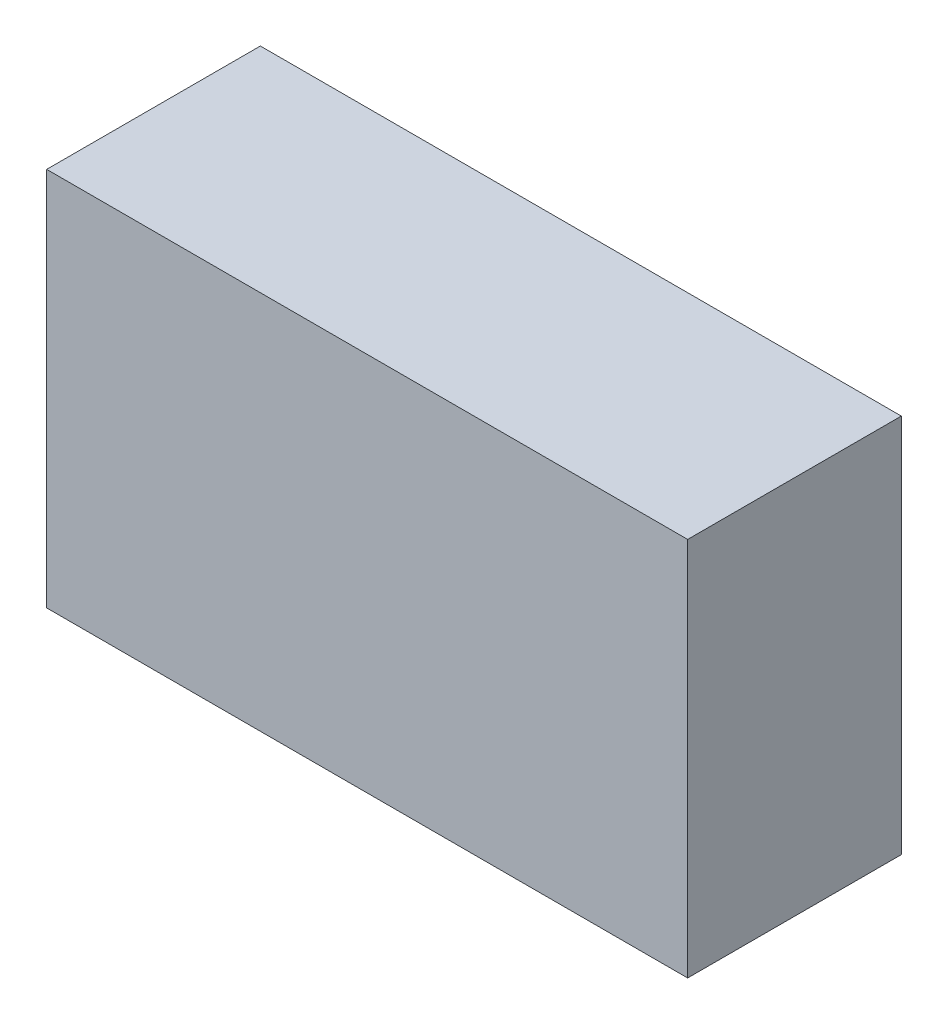
ISO-10303-21;
HEADER;
FILE_DESCRIPTION(('STEP AP214'),'2;1');
FILE_NAME('part.step','',(''),(''),'','','');
FILE_SCHEMA(('AUTOMOTIVE_DESIGN { 1 0 10303 214 1 1 1 1 }'));
ENDSEC;
DATA;
#1=APPLICATION_CONTEXT('core data for automotive mechanical design processes');
#2=APPLICATION_PROTOCOL_DEFINITION('international standard','automotive_design',2000,#1);
#3=PRODUCT_CONTEXT('',#1,'mechanical');
#4=PRODUCT('Part','Part','',(#3));
#5=PRODUCT_RELATED_PRODUCT_CATEGORY('part','',(#4));
#6=PRODUCT_DEFINITION_FORMATION('','',#4);
#7=PRODUCT_DEFINITION_CONTEXT('part definition',#1,'design');
#8=PRODUCT_DEFINITION('design','',#6,#7);
#9=PRODUCT_DEFINITION_SHAPE('','',#8);
#10=(LENGTH_UNIT() NAMED_UNIT(*) SI_UNIT(.MILLI.,.METRE.));
#11=(NAMED_UNIT(*) PLANE_ANGLE_UNIT() SI_UNIT($,.RADIAN.));
#12=(NAMED_UNIT(*) SI_UNIT($,.STERADIAN.) SOLID_ANGLE_UNIT());
#13=UNCERTAINTY_MEASURE_WITH_UNIT(LENGTH_MEASURE(1.E-05),#10,'distance_accuracy_value','');
#14=(GEOMETRIC_REPRESENTATION_CONTEXT(3) GLOBAL_UNCERTAINTY_ASSIGNED_CONTEXT((#13)) GLOBAL_UNIT_ASSIGNED_CONTEXT((#10,
#11,#12)) REPRESENTATION_CONTEXT('',''));
#15=CARTESIAN_POINT('',(0.,0.,0.));
#16=DIRECTION('',(0.,0.,1.));
#17=DIRECTION('',(1.,0.,0.));
#18=AXIS2_PLACEMENT_3D('',#15,#16,#17);
#19=CARTESIAN_POINT('',(53.3,40.,-35.));
#20=DIRECTION('',(0.,0.,-1.));
#21=DIRECTION('',(-1.,0.,0.));
#22=AXIS2_PLACEMENT_3D('',#19,#20,#21);
#23=CYLINDRICAL_SURFACE('',#22,1.5);
#24=CARTESIAN_POINT('',(53.3,40.,-45.));
#25=DIRECTION('',(0.,0.,-1.));
#26=DIRECTION('',(-1.,0.,0.));
#27=AXIS2_PLACEMENT_3D('',#24,#25,#26);
#28=CIRCLE('',#27,1.5);
#29=CARTESIAN_POINT('',(51.8,40.,-45.));
#30=VERTEX_POINT('',#29);
#31=EDGE_CURVE('E191',#30,#30,#28,.T.);
#32=ORIENTED_EDGE('',*,*,#31,.T.);
#33=EDGE_LOOP('',(#32));
#34=FACE_BOUND('',#33,.T.);
#35=CARTESIAN_POINT('',(53.3,40.,-40.35));
#36=DIRECTION('',(0.,0.,1.));
#37=DIRECTION('',(1.,0.,0.));
#38=AXIS2_PLACEMENT_3D('',#35,#36,#37);
#39=CIRCLE('',#38,1.5);
#40=CARTESIAN_POINT('',(54.8,40.,-40.35));
#41=VERTEX_POINT('',#40);
#42=EDGE_CURVE('E175',#41,#41,#39,.F.);
#43=ORIENTED_EDGE('',*,*,#42,.F.);
#44=EDGE_LOOP('',(#43));
#45=FACE_BOUND('',#44,.T.);
#46=ADVANCED_FACE('F37',(#34,#45),#23,.F.);
#47=CARTESIAN_POINT('',(53.3,58.35,-35.));
#48=DIRECTION('',(0.,0.,-1.));
#49=DIRECTION('',(-1.,0.,0.));
#50=AXIS2_PLACEMENT_3D('',#47,#48,#49);
#51=CYLINDRICAL_SURFACE('',#50,1.5);
#52=CARTESIAN_POINT('',(53.3,58.35,-45.));
#53=DIRECTION('',(0.,0.,-1.));
#54=DIRECTION('',(-1.,0.,0.));
#55=AXIS2_PLACEMENT_3D('',#52,#53,#54);
#56=CIRCLE('',#55,1.5);
#57=CARTESIAN_POINT('',(51.8,58.35,-45.));
#58=VERTEX_POINT('',#57);
#59=EDGE_CURVE('E188',#58,#58,#56,.T.);
#60=ORIENTED_EDGE('',*,*,#59,.T.);
#61=EDGE_LOOP('',(#60));
#62=FACE_BOUND('',#61,.T.);
#63=CARTESIAN_POINT('',(53.3,58.35,-40.35));
#64=DIRECTION('',(0.,0.,1.));
#65=DIRECTION('',(1.,0.,0.));
#66=AXIS2_PLACEMENT_3D('',#63,#64,#65);
#67=CIRCLE('',#66,1.5);
#68=CARTESIAN_POINT('',(54.8,58.35,-40.35));
#69=VERTEX_POINT('',#68);
#70=EDGE_CURVE('E172',#69,#69,#67,.F.);
#71=ORIENTED_EDGE('',*,*,#70,.F.);
#72=EDGE_LOOP('',(#71));
#73=FACE_BOUND('',#72,.T.);
#74=ADVANCED_FACE('F271',(#62,#73),#51,.F.);
#75=CARTESIAN_POINT('',(53.3,21.65,-35.));
#76=DIRECTION('',(0.,0.,-1.));
#77=DIRECTION('',(-1.,0.,0.));
#78=AXIS2_PLACEMENT_3D('',#75,#76,#77);
#79=CYLINDRICAL_SURFACE('',#78,1.5);
#80=CARTESIAN_POINT('',(53.3,21.65,-45.));
#81=DIRECTION('',(0.,0.,-1.));
#82=DIRECTION('',(-1.,0.,0.));
#83=AXIS2_PLACEMENT_3D('',#80,#81,#82);
#84=CIRCLE('',#83,1.5);
#85=CARTESIAN_POINT('',(51.8,21.65,-45.));
#86=VERTEX_POINT('',#85);
#87=EDGE_CURVE('E192',#86,#86,#84,.T.);
#88=ORIENTED_EDGE('',*,*,#87,.T.);
#89=EDGE_LOOP('',(#88));
#90=FACE_BOUND('',#89,.T.);
#91=CARTESIAN_POINT('',(53.3,21.65,-40.35));
#92=DIRECTION('',(0.,0.,1.));
#93=DIRECTION('',(1.,0.,0.));
#94=AXIS2_PLACEMENT_3D('',#91,#92,#93);
#95=CIRCLE('',#94,1.5);
#96=CARTESIAN_POINT('',(54.8,21.65,-40.35));
#97=VERTEX_POINT('',#96);
#98=EDGE_CURVE('E169',#97,#97,#95,.F.);
#99=ORIENTED_EDGE('',*,*,#98,.F.);
#100=EDGE_LOOP('',(#99));
#101=FACE_BOUND('',#100,.T.);
#102=ADVANCED_FACE('F277',(#90,#101),#79,.F.);
#103=CARTESIAN_POINT('',(23.3,58.35,-35.));
#104=DIRECTION('',(0.,0.,-1.));
#105=DIRECTION('',(-1.,0.,0.));
#106=AXIS2_PLACEMENT_3D('',#103,#104,#105);
#107=CYLINDRICAL_SURFACE('',#106,1.5);
#108=CARTESIAN_POINT('',(23.3,58.35,-45.));
#109=DIRECTION('',(0.,0.,-1.));
#110=DIRECTION('',(-1.,0.,0.));
#111=AXIS2_PLACEMENT_3D('',#108,#109,#110);
#112=CIRCLE('',#111,1.5);
#113=CARTESIAN_POINT('',(21.8,58.35,-45.));
#114=VERTEX_POINT('',#113);
#115=EDGE_CURVE('E195',#114,#114,#112,.T.);
#116=ORIENTED_EDGE('',*,*,#115,.T.);
#117=EDGE_LOOP('',(#116));
#118=FACE_BOUND('',#117,.T.);
#119=CARTESIAN_POINT('',(23.3,58.35,-40.35));
#120=DIRECTION('',(0.,0.,1.));
#121=DIRECTION('',(1.,0.,0.));
#122=AXIS2_PLACEMENT_3D('',#119,#120,#121);
#123=CIRCLE('',#122,1.5);
#124=CARTESIAN_POINT('',(24.8,58.35,-40.35));
#125=VERTEX_POINT('',#124);
#126=EDGE_CURVE('E166',#125,#125,#123,.F.);
#127=ORIENTED_EDGE('',*,*,#126,.F.);
#128=EDGE_LOOP('',(#127));
#129=FACE_BOUND('',#128,.T.);
#130=ADVANCED_FACE('F337',(#118,#129),#107,.F.);
#131=CARTESIAN_POINT('',(23.3,21.65,-35.));
#132=DIRECTION('',(0.,0.,-1.));
#133=DIRECTION('',(-1.,0.,0.));
#134=AXIS2_PLACEMENT_3D('',#131,#132,#133);
#135=CYLINDRICAL_SURFACE('',#134,1.5);
#136=CARTESIAN_POINT('',(23.3,21.65,-45.));
#137=DIRECTION('',(0.,0.,-1.));
#138=DIRECTION('',(-1.,0.,0.));
#139=AXIS2_PLACEMENT_3D('',#136,#137,#138);
#140=CIRCLE('',#139,1.5);
#141=CARTESIAN_POINT('',(21.8,21.65,-45.));
#142=VERTEX_POINT('',#141);
#143=EDGE_CURVE('E198',#142,#142,#140,.T.);
#144=ORIENTED_EDGE('',*,*,#143,.T.);
#145=EDGE_LOOP('',(#144));
#146=FACE_BOUND('',#145,.T.);
#147=CARTESIAN_POINT('',(23.3,21.65,-40.35));
#148=DIRECTION('',(0.,0.,1.));
#149=DIRECTION('',(1.,0.,0.));
#150=AXIS2_PLACEMENT_3D('',#147,#148,#149);
#151=CIRCLE('',#150,1.5);
#152=CARTESIAN_POINT('',(24.8,21.65,-40.35));
#153=VERTEX_POINT('',#152);
#154=EDGE_CURVE('E163',#153,#153,#151,.F.);
#155=ORIENTED_EDGE('',*,*,#154,.F.);
#156=EDGE_LOOP('',(#155));
#157=FACE_BOUND('',#156,.T.);
#158=ADVANCED_FACE('F347',(#146,#157),#135,.F.);
#159=CARTESIAN_POINT('',(115.7,40.,-35.));
#160=DIRECTION('',(0.,0.,-1.));
#161=DIRECTION('',(-1.,0.,0.));
#162=AXIS2_PLACEMENT_3D('',#159,#160,#161);
#163=CYLINDRICAL_SURFACE('',#162,1.5);
#164=CARTESIAN_POINT('',(115.7,40.,-45.));
#165=DIRECTION('',(0.,0.,-1.));
#166=DIRECTION('',(-1.,0.,0.));
#167=AXIS2_PLACEMENT_3D('',#164,#165,#166);
#168=CIRCLE('',#167,1.5);
#169=CARTESIAN_POINT('',(114.2,40.,-45.));
#170=VERTEX_POINT('',#169);
#171=EDGE_CURVE('E201',#170,#170,#168,.T.);
#172=ORIENTED_EDGE('',*,*,#171,.T.);
#173=EDGE_LOOP('',(#172));
#174=FACE_BOUND('',#173,.T.);
#175=CARTESIAN_POINT('',(115.7,40.,-40.35));
#176=DIRECTION('',(0.,0.,1.));
#177=DIRECTION('',(1.,0.,0.));
#178=AXIS2_PLACEMENT_3D('',#175,#176,#177);
#179=CIRCLE('',#178,1.5);
#180=CARTESIAN_POINT('',(117.2,40.,-40.35));
#181=VERTEX_POINT('',#180);
#182=EDGE_CURVE('E160',#181,#181,#179,.F.);
#183=ORIENTED_EDGE('',*,*,#182,.F.);
#184=EDGE_LOOP('',(#183));
#185=FACE_BOUND('',#184,.T.);
#186=ADVANCED_FACE('F357',(#174,#185),#163,.F.);
#187=CARTESIAN_POINT('',(115.7,62.,-35.));
#188=DIRECTION('',(0.,0.,-1.));
#189=DIRECTION('',(-1.,0.,0.));
#190=AXIS2_PLACEMENT_3D('',#187,#188,#189);
#191=CYLINDRICAL_SURFACE('',#190,1.5);
#192=CARTESIAN_POINT('',(115.7,62.,-45.));
#193=DIRECTION('',(0.,0.,-1.));
#194=DIRECTION('',(-1.,0.,0.));
#195=AXIS2_PLACEMENT_3D('',#192,#193,#194);
#196=CIRCLE('',#195,1.5);
#197=CARTESIAN_POINT('',(114.2,62.,-45.));
#198=VERTEX_POINT('',#197);
#199=EDGE_CURVE('E182',#198,#198,#196,.T.);
#200=ORIENTED_EDGE('',*,*,#199,.T.);
#201=EDGE_LOOP('',(#200));
#202=FACE_BOUND('',#201,.T.);
#203=CARTESIAN_POINT('',(115.7,62.,-40.35));
#204=DIRECTION('',(0.,0.,1.));
#205=DIRECTION('',(1.,0.,0.));
#206=AXIS2_PLACEMENT_3D('',#203,#204,#205);
#207=CIRCLE('',#206,1.5);
#208=CARTESIAN_POINT('',(117.2,62.,-40.35));
#209=VERTEX_POINT('',#208);
#210=EDGE_CURVE('E41',#209,#209,#207,.F.);
#211=ORIENTED_EDGE('',*,*,#210,.F.);
#212=EDGE_LOOP('',(#211));
#213=FACE_BOUND('',#212,.T.);
#214=ADVANCED_FACE('F253',(#202,#213),#191,.F.);
#215=CARTESIAN_POINT('',(0.,0.,-45.));
#216=DIRECTION('',(-1.,0.,0.));
#217=DIRECTION('',(0.,0.,1.));
#218=AXIS2_PLACEMENT_3D('',#215,#216,#217);
#219=PLANE('',#218);
#220=CARTESIAN_POINT('',(0.,54.05,-15.));
#221=DIRECTION('',(-1.,0.,0.));
#222=DIRECTION('',(0.,0.,1.));
#223=AXIS2_PLACEMENT_3D('',#220,#221,#222);
#224=CIRCLE('',#223,1.5);
#225=CARTESIAN_POINT('',(0.,54.05,-13.5));
#226=VERTEX_POINT('',#225);
#227=EDGE_CURVE('E179',#226,#226,#224,.T.);
#228=ORIENTED_EDGE('',*,*,#227,.F.);
#229=EDGE_LOOP('',(#228));
#230=FACE_BOUND('',#229,.T.);
#231=CARTESIAN_POINT('',(0.,25.95,-15.));
#232=DIRECTION('',(-1.,0.,0.));
#233=DIRECTION('',(0.,0.,1.));
#234=AXIS2_PLACEMENT_3D('',#231,#232,#233);
#235=CIRCLE('',#234,1.5);
#236=CARTESIAN_POINT('',(0.,25.95,-13.5));
#237=VERTEX_POINT('',#236);
#238=EDGE_CURVE('E183',#237,#237,#235,.T.);
#239=ORIENTED_EDGE('',*,*,#238,.F.);
#240=EDGE_LOOP('',(#239));
#241=FACE_BOUND('',#240,.T.);
#242=CARTESIAN_POINT('',(0.,40.,-31.));
#243=DIRECTION('',(-1.,0.,0.));
#244=DIRECTION('',(0.,0.,1.));
#245=AXIS2_PLACEMENT_3D('',#242,#243,#244);
#246=CIRCLE('',#245,1.5);
#247=CARTESIAN_POINT('',(0.,40.,-29.5));
#248=VERTEX_POINT('',#247);
#249=EDGE_CURVE('E178',#248,#248,#246,.T.);
#250=ORIENTED_EDGE('',*,*,#249,.F.);
#251=EDGE_LOOP('',(#250));
#252=FACE_BOUND('',#251,.T.);
#253=DIRECTION('',(0.,-1.,0.));
#254=VECTOR('',#253,1.);
#255=CARTESIAN_POINT('',(0.,0.,0.));
#256=LINE('',#255,#254);
#257=CARTESIAN_POINT('',(0.,80.,0.));
#258=VERTEX_POINT('',#257);
#259=CARTESIAN_POINT('',(0.,0.,0.));
#260=VERTEX_POINT('',#259);
#261=EDGE_CURVE('E208',#258,#260,#256,.T.);
#262=ORIENTED_EDGE('',*,*,#261,.F.);
#263=DIRECTION('',(0.,0.,1.));
#264=VECTOR('',#263,1.);
#265=CARTESIAN_POINT('',(0.,80.,-45.));
#266=LINE('',#265,#264);
#267=CARTESIAN_POINT('',(0.,80.,-45.));
#268=VERTEX_POINT('',#267);
#269=EDGE_CURVE('E11',#268,#258,#266,.T.);
#270=ORIENTED_EDGE('',*,*,#269,.F.);
#271=DIRECTION('',(0.,-1.,0.));
#272=VECTOR('',#271,1.);
#273=CARTESIAN_POINT('',(0.,0.,-45.));
#274=LINE('',#273,#272);
#275=CARTESIAN_POINT('',(0.,0.,-45.));
#276=VERTEX_POINT('',#275);
#277=EDGE_CURVE('E209',#268,#276,#274,.T.);
#278=ORIENTED_EDGE('',*,*,#277,.T.);
#279=DIRECTION('',(0.,0.,1.));
#280=VECTOR('',#279,1.);
#281=CARTESIAN_POINT('',(0.,0.,-45.));
#282=LINE('',#281,#280);
#283=EDGE_CURVE('E82',#276,#260,#282,.T.);
#284=ORIENTED_EDGE('',*,*,#283,.T.);
#285=EDGE_LOOP('',(#262,#270,#278,#284));
#286=FACE_BOUND('',#285,.T.);
#287=ADVANCED_FACE('F39',(#230,#241,#252,#286),#219,.T.);
#288=CARTESIAN_POINT('',(0.,80.,-45.));
#289=DIRECTION('',(0.,1.,0.));
#290=DIRECTION('',(0.,0.,1.));
#291=AXIS2_PLACEMENT_3D('',#288,#289,#290);
#292=PLANE('',#291);
#293=DIRECTION('',(-1.,0.,0.));
#294=VECTOR('',#293,1.);
#295=CARTESIAN_POINT('',(0.,80.,0.));
#296=LINE('',#295,#294);
#297=CARTESIAN_POINT('',(135.,80.,0.));
#298=VERTEX_POINT('',#297);
#299=EDGE_CURVE('E212',#298,#258,#296,.T.);
#300=ORIENTED_EDGE('',*,*,#299,.F.);
#301=DIRECTION('',(0.,0.,1.));
#302=VECTOR('',#301,1.);
#303=CARTESIAN_POINT('',(135.,80.,-45.));
#304=LINE('',#303,#302);
#305=CARTESIAN_POINT('',(135.,80.,-45.));
#306=VERTEX_POINT('',#305);
#307=EDGE_CURVE('E47',#306,#298,#304,.T.);
#308=ORIENTED_EDGE('',*,*,#307,.F.);
#309=DIRECTION('',(-1.,0.,0.));
#310=VECTOR('',#309,1.);
#311=CARTESIAN_POINT('',(0.,80.,-45.));
#312=LINE('',#311,#310);
#313=EDGE_CURVE('E216',#306,#268,#312,.T.);
#314=ORIENTED_EDGE('',*,*,#313,.T.);
#315=ORIENTED_EDGE('',*,*,#269,.T.);
#316=EDGE_LOOP('',(#300,#308,#314,#315));
#317=FACE_BOUND('',#316,.T.);
#318=ADVANCED_FACE('F252',(#317),#292,.T.);
#319=CARTESIAN_POINT('',(135.,0.,-45.));
#320=DIRECTION('',(1.,0.,0.));
#321=DIRECTION('',(0.,0.,-1.));
#322=AXIS2_PLACEMENT_3D('',#319,#320,#321);
#323=PLANE('',#322);
#324=DIRECTION('',(0.,1.,0.));
#325=VECTOR('',#324,1.);
#326=CARTESIAN_POINT('',(135.,0.,0.));
#327=LINE('',#326,#325);
#328=CARTESIAN_POINT('',(135.,0.,0.));
#329=VERTEX_POINT('',#328);
#330=EDGE_CURVE('E223',#329,#298,#327,.T.);
#331=ORIENTED_EDGE('',*,*,#330,.F.);
#332=DIRECTION('',(0.,0.,1.));
#333=VECTOR('',#332,1.);
#334=CARTESIAN_POINT('',(135.,0.,-45.));
#335=LINE('',#334,#333);
#336=CARTESIAN_POINT('',(135.,0.,-45.));
#337=VERTEX_POINT('',#336);
#338=EDGE_CURVE('E228',#337,#329,#335,.T.);
#339=ORIENTED_EDGE('',*,*,#338,.F.);
#340=DIRECTION('',(0.,1.,0.));
#341=VECTOR('',#340,1.);
#342=CARTESIAN_POINT('',(135.,0.,-45.));
#343=LINE('',#342,#341);
#344=EDGE_CURVE('E214',#337,#306,#343,.T.);
#345=ORIENTED_EDGE('',*,*,#344,.T.);
#346=ORIENTED_EDGE('',*,*,#307,.T.);
#347=EDGE_LOOP('',(#331,#339,#345,#346));
#348=FACE_BOUND('',#347,.T.);
#349=ADVANCED_FACE('F258',(#348),#323,.T.);
#350=CARTESIAN_POINT('',(0.,0.,-45.));
#351=DIRECTION('',(0.,-1.,0.));
#352=DIRECTION('',(0.,0.,-1.));
#353=AXIS2_PLACEMENT_3D('',#350,#351,#352);
#354=PLANE('',#353);
#355=DIRECTION('',(1.,0.,0.));
#356=VECTOR('',#355,1.);
#357=CARTESIAN_POINT('',(0.,0.,0.));
#358=LINE('',#357,#356);
#359=EDGE_CURVE('E220',#260,#329,#358,.T.);
#360=ORIENTED_EDGE('',*,*,#359,.F.);
#361=ORIENTED_EDGE('',*,*,#283,.F.);
#362=DIRECTION('',(1.,0.,0.));
#363=VECTOR('',#362,1.);
#364=CARTESIAN_POINT('',(0.,0.,-45.));
#365=LINE('',#364,#363);
#366=EDGE_CURVE('E211',#276,#337,#365,.T.);
#367=ORIENTED_EDGE('',*,*,#366,.T.);
#368=ORIENTED_EDGE('',*,*,#338,.T.);
#369=EDGE_LOOP('',(#360,#361,#367,#368));
#370=FACE_BOUND('',#369,.T.);
#371=ADVANCED_FACE('F261',(#370),#354,.T.);
#372=CARTESIAN_POINT('',(0.,0.,-45.));
#373=DIRECTION('',(0.,0.,-1.));
#374=DIRECTION('',(-1.,0.,0.));
#375=AXIS2_PLACEMENT_3D('',#372,#373,#374);
#376=PLANE('',#375);
#377=ORIENTED_EDGE('',*,*,#199,.F.);
#378=EDGE_LOOP('',(#377));
#379=FACE_BOUND('',#378,.T.);
#380=ORIENTED_EDGE('',*,*,#171,.F.);
#381=EDGE_LOOP('',(#380));
#382=FACE_BOUND('',#381,.T.);
#383=ORIENTED_EDGE('',*,*,#143,.F.);
#384=EDGE_LOOP('',(#383));
#385=FACE_BOUND('',#384,.T.);
#386=ORIENTED_EDGE('',*,*,#115,.F.);
#387=EDGE_LOOP('',(#386));
#388=FACE_BOUND('',#387,.T.);
#389=ORIENTED_EDGE('',*,*,#87,.F.);
#390=EDGE_LOOP('',(#389));
#391=FACE_BOUND('',#390,.T.);
#392=ORIENTED_EDGE('',*,*,#59,.F.);
#393=EDGE_LOOP('',(#392));
#394=FACE_BOUND('',#393,.T.);
#395=ORIENTED_EDGE('',*,*,#31,.F.);
#396=EDGE_LOOP('',(#395));
#397=FACE_BOUND('',#396,.T.);
#398=ORIENTED_EDGE('',*,*,#277,.F.);
#399=ORIENTED_EDGE('',*,*,#313,.F.);
#400=ORIENTED_EDGE('',*,*,#344,.F.);
#401=ORIENTED_EDGE('',*,*,#366,.F.);
#402=EDGE_LOOP('',(#398,#399,#400,#401));
#403=FACE_BOUND('',#402,.T.);
#404=ADVANCED_FACE('F260',(#379,#382,#385,#388,#391,#394,#397,#403),#376,.T.);
#405=CARTESIAN_POINT('',(0.,0.,0.));
#406=DIRECTION('',(0.,0.,-1.));
#407=DIRECTION('',(-1.,0.,0.));
#408=AXIS2_PLACEMENT_3D('',#405,#406,#407);
#409=PLANE('',#408);
#410=ORIENTED_EDGE('',*,*,#261,.T.);
#411=ORIENTED_EDGE('',*,*,#359,.T.);
#412=ORIENTED_EDGE('',*,*,#330,.T.);
#413=ORIENTED_EDGE('',*,*,#299,.T.);
#414=EDGE_LOOP('',(#410,#411,#412,#413));
#415=FACE_BOUND('',#414,.T.);
#416=ADVANCED_FACE('F247',(#415),#409,.F.);
#417=CARTESIAN_POINT('',(10.,40.,-31.));
#418=DIRECTION('',(-1.,0.,0.));
#419=DIRECTION('',(0.,0.,1.));
#420=AXIS2_PLACEMENT_3D('',#417,#418,#419);
#421=CYLINDRICAL_SURFACE('',#420,1.5);
#422=CARTESIAN_POINT('',(6.97483396079881,40.,-31.));
#423=DIRECTION('',(-0.999657324975557,0.,-0.0261769483078695));
#424=DIRECTION('',(-0.0261769483078695,0.,0.999657324975557));
#425=AXIS2_PLACEMENT_3D('',#422,#423,#424);
#426=ELLIPSE('',#425,1.5005141887363,1.5);
#427=CARTESIAN_POINT('',(6.93555507844503,40.,-29.5));
#428=VERTEX_POINT('',#427);
#429=EDGE_CURVE('E157',#428,#428,#426,.F.);
#430=ORIENTED_EDGE('',*,*,#429,.T.);
#431=EDGE_LOOP('',(#430));
#432=FACE_BOUND('',#431,.T.);
#433=ORIENTED_EDGE('',*,*,#249,.T.);
#434=EDGE_LOOP('',(#433));
#435=FACE_BOUND('',#434,.T.);
#436=ADVANCED_FACE('F243',(#432,#435),#421,.F.);
#437=CARTESIAN_POINT('',(10.,25.95,-15.));
#438=DIRECTION('',(-1.,0.,0.));
#439=DIRECTION('',(0.,0.,1.));
#440=AXIS2_PLACEMENT_3D('',#437,#438,#439);
#441=CYLINDRICAL_SURFACE('',#440,1.5);
#442=CARTESIAN_POINT('',(6.55585921569188,25.95,-15.));
#443=DIRECTION('',(-0.999657324975557,0.,-0.0261769483078695));
#444=DIRECTION('',(-0.0261769483078695,0.,0.999657324975557));
#445=AXIS2_PLACEMENT_3D('',#442,#443,#444);
#446=ELLIPSE('',#445,1.5005141887363,1.5);
#447=CARTESIAN_POINT('',(6.5165803333381,25.95,-13.5));
#448=VERTEX_POINT('',#447);
#449=EDGE_CURVE('E154',#448,#448,#446,.F.);
#450=ORIENTED_EDGE('',*,*,#449,.T.);
#451=EDGE_LOOP('',(#450));
#452=FACE_BOUND('',#451,.T.);
#453=ORIENTED_EDGE('',*,*,#238,.T.);
#454=EDGE_LOOP('',(#453));
#455=FACE_BOUND('',#454,.T.);
#456=ADVANCED_FACE('F246',(#452,#455),#441,.F.);
#457=CARTESIAN_POINT('',(10.,54.05,-15.));
#458=DIRECTION('',(-1.,0.,0.));
#459=DIRECTION('',(0.,0.,1.));
#460=AXIS2_PLACEMENT_3D('',#457,#458,#459);
#461=CYLINDRICAL_SURFACE('',#460,1.5);
#462=CARTESIAN_POINT('',(6.55585921569187,54.05,-15.));
#463=DIRECTION('',(-0.999657324975557,0.,-0.0261769483078695));
#464=DIRECTION('',(-0.0261769483078695,0.,0.999657324975557));
#465=AXIS2_PLACEMENT_3D('',#462,#463,#464);
#466=ELLIPSE('',#465,1.5005141887363,1.5);
#467=CARTESIAN_POINT('',(6.5165803333381,54.05,-13.5));
#468=VERTEX_POINT('',#467);
#469=EDGE_CURVE('E121',#468,#468,#466,.F.);
#470=ORIENTED_EDGE('',*,*,#469,.T.);
#471=EDGE_LOOP('',(#470));
#472=FACE_BOUND('',#471,.T.);
#473=ORIENTED_EDGE('',*,*,#227,.T.);
#474=EDGE_LOOP('',(#473));
#475=FACE_BOUND('',#474,.T.);
#476=ADVANCED_FACE('F233',(#472,#475),#461,.F.);
#477=CARTESIAN_POINT('',(67.5,40.,-40.35));
#478=DIRECTION('',(0.,0.,1.));
#479=DIRECTION('',(1.,0.,0.));
#480=AXIS2_PLACEMENT_3D('',#477,#478,#479);
#481=PLANE('',#480);
#482=DIRECTION('',(0.,1.,0.));
#483=VECTOR('',#482,1.);
#484=CARTESIAN_POINT('',(127.780327672529,40.,-40.35));
#485=LINE('',#484,#483);
#486=CARTESIAN_POINT('',(127.780327672529,7.18150486374522,-40.35));
#487=VERTEX_POINT('',#486);
#488=CARTESIAN_POINT('',(127.780327672529,72.8184951362548,-40.35));
#489=VERTEX_POINT('',#488);
#490=EDGE_CURVE('E125',#487,#489,#485,.T.);
#491=ORIENTED_EDGE('',*,*,#490,.T.);
#492=DIRECTION('',(-1.,0.,0.));
#493=VECTOR('',#492,1.);
#494=CARTESIAN_POINT('',(67.5,72.8184951362548,-40.35));
#495=LINE('',#494,#493);
#496=CARTESIAN_POINT('',(7.21967232747066,72.8184951362548,-40.35));
#497=VERTEX_POINT('',#496);
#498=EDGE_CURVE('E131',#489,#497,#495,.T.);
#499=ORIENTED_EDGE('',*,*,#498,.T.);
#500=DIRECTION('',(0.,-1.,0.));
#501=VECTOR('',#500,1.);
#502=CARTESIAN_POINT('',(7.21967232747067,40.,-40.35));
#503=LINE('',#502,#501);
#504=CARTESIAN_POINT('',(7.21967232747068,7.18150486374522,-40.35));
#505=VERTEX_POINT('',#504);
#506=EDGE_CURVE('E137',#497,#505,#503,.T.);
#507=ORIENTED_EDGE('',*,*,#506,.T.);
#508=DIRECTION('',(1.,0.,0.));
#509=VECTOR('',#508,1.);
#510=CARTESIAN_POINT('',(67.5,7.18150486374522,-40.35));
#511=LINE('',#510,#509);
#512=EDGE_CURVE('E115',#505,#487,#511,.T.);
#513=ORIENTED_EDGE('',*,*,#512,.T.);
#514=EDGE_LOOP('',(#491,#499,#507,#513));
#515=FACE_BOUND('',#514,.T.);
#516=ORIENTED_EDGE('',*,*,#210,.T.);
#517=EDGE_LOOP('',(#516));
#518=FACE_BOUND('',#517,.T.);
#519=ORIENTED_EDGE('',*,*,#182,.T.);
#520=EDGE_LOOP('',(#519));
#521=FACE_BOUND('',#520,.T.);
#522=ORIENTED_EDGE('',*,*,#154,.T.);
#523=EDGE_LOOP('',(#522));
#524=FACE_BOUND('',#523,.T.);
#525=ORIENTED_EDGE('',*,*,#126,.T.);
#526=EDGE_LOOP('',(#525));
#527=FACE_BOUND('',#526,.T.);
#528=ORIENTED_EDGE('',*,*,#98,.T.);
#529=EDGE_LOOP('',(#528));
#530=FACE_BOUND('',#529,.T.);
#531=ORIENTED_EDGE('',*,*,#70,.T.);
#532=EDGE_LOOP('',(#531));
#533=FACE_BOUND('',#532,.T.);
#534=ORIENTED_EDGE('',*,*,#42,.T.);
#535=EDGE_LOOP('',(#534));
#536=FACE_BOUND('',#535,.T.);
#537=ADVANCED_FACE('F134',(#515,#518,#521,#524,#527,#530,#533,#536),#481,.T.);
#538=CARTESIAN_POINT('',(6.29400000000004,73.74875,-5.));
#539=DIRECTION('',(-0.999657324975557,0.,-0.0261769483078695));
#540=DIRECTION('',(-0.0261769483078695,0.,0.999657324975558));
#541=AXIS2_PLACEMENT_3D('',#538,#539,#540);
#542=PLANE('',#541);
#543=ORIENTED_EDGE('',*,*,#449,.F.);
#544=EDGE_LOOP('',(#543));
#545=FACE_BOUND('',#544,.T.);
#546=DIRECTION('',(0.,-1.,0.));
#547=VECTOR('',#546,1.);
#548=CARTESIAN_POINT('',(6.29400000000004,73.74875,-5.));
#549=LINE('',#548,#547);
#550=CARTESIAN_POINT('',(6.29400000000004,73.74875,-5.));
#551=VERTEX_POINT('',#550);
#552=CARTESIAN_POINT('',(6.29400000000005,6.25124999999999,-5.));
#553=VERTEX_POINT('',#552);
#554=EDGE_CURVE('E145',#551,#553,#549,.T.);
#555=ORIENTED_EDGE('',*,*,#554,.T.);
#556=DIRECTION('',(-0.0261678953385402,-0.0262974393748696,0.999311606024806));
#557=VECTOR('',#556,1.);
#558=CARTESIAN_POINT('',(6.3399921337941,6.2974698176247,-6.75636872937754));
#559=LINE('',#558,#557);
#560=EDGE_CURVE('E122',#505,#553,#559,.T.);
#561=ORIENTED_EDGE('',*,*,#560,.F.);
#562=ORIENTED_EDGE('',*,*,#506,.F.);
#563=DIRECTION('',(-0.0261678953385402,0.0262974393748696,0.999311606024806));
#564=VECTOR('',#563,1.);
#565=CARTESIAN_POINT('',(6.37782325738107,73.6645117759982,-8.20108105263997));
#566=LINE('',#565,#564);
#567=EDGE_CURVE('E139',#497,#551,#566,.T.);
#568=ORIENTED_EDGE('',*,*,#567,.T.);
#569=EDGE_LOOP('',(#555,#561,#562,#568));
#570=FACE_BOUND('',#569,.T.);
#571=ORIENTED_EDGE('',*,*,#469,.F.);
#572=EDGE_LOOP('',(#571));
#573=FACE_BOUND('',#572,.T.);
#574=ORIENTED_EDGE('',*,*,#429,.F.);
#575=EDGE_LOOP('',(#574));
#576=FACE_BOUND('',#575,.T.);
#577=ADVANCED_FACE('F236',(#545,#570,#573,#576),#542,.F.);
#578=CARTESIAN_POINT('',(128.706,6.25124999999999,-5.));
#579=DIRECTION('',(0.999657324975557,0.,-0.0261769483078695));
#580=DIRECTION('',(-0.0261769483078695,0.,-0.999657324975558));
#581=AXIS2_PLACEMENT_3D('',#578,#579,#580);
#582=PLANE('',#581);
#583=DIRECTION('',(0.,1.,0.));
#584=VECTOR('',#583,1.);
#585=CARTESIAN_POINT('',(128.706,6.25124999999999,-5.));
#586=LINE('',#585,#584);
#587=CARTESIAN_POINT('',(128.706,6.25124999999999,-5.));
#588=VERTEX_POINT('',#587);
#589=CARTESIAN_POINT('',(128.706,73.74875,-5.));
#590=VERTEX_POINT('',#589);
#591=EDGE_CURVE('E152',#588,#590,#586,.T.);
#592=ORIENTED_EDGE('',*,*,#591,.T.);
#593=DIRECTION('',(0.0261678953385402,0.0262974393748696,0.999311606024806));
#594=VECTOR('',#593,1.);
#595=CARTESIAN_POINT('',(128.660007866206,73.7025301823753,-6.75636872937754));
#596=LINE('',#595,#594);
#597=EDGE_CURVE('E127',#489,#590,#596,.T.);
#598=ORIENTED_EDGE('',*,*,#597,.F.);
#599=ORIENTED_EDGE('',*,*,#490,.F.);
#600=DIRECTION('',(0.0261678953385402,-0.0262974393748696,0.999311606024806));
#601=VECTOR('',#600,1.);
#602=CARTESIAN_POINT('',(128.622176742619,6.33548822400172,-8.20108105263997));
#603=LINE('',#602,#601);
#604=EDGE_CURVE('E111',#487,#588,#603,.T.);
#605=ORIENTED_EDGE('',*,*,#604,.T.);
#606=EDGE_LOOP('',(#592,#598,#599,#605));
#607=FACE_BOUND('',#606,.T.);
#608=ADVANCED_FACE('F126',(#607),#582,.F.);
#609=CARTESIAN_POINT('',(6.29400000000005,6.25124999999999,-5.));
#610=DIRECTION('',(0.,-0.99965392552087,-0.0263064477023425));
#611=DIRECTION('',(0.,0.0263064477023425,-0.999653925520869));
#612=AXIS2_PLACEMENT_3D('',#609,#610,#611);
#613=PLANE('',#612);
#614=DIRECTION('',(1.,0.,0.));
#615=VECTOR('',#614,1.);
#616=CARTESIAN_POINT('',(6.29400000000005,6.25124999999999,-5.));
#617=LINE('',#616,#615);
#618=EDGE_CURVE('E117',#553,#588,#617,.T.);
#619=ORIENTED_EDGE('',*,*,#618,.T.);
#620=ORIENTED_EDGE('',*,*,#604,.F.);
#621=ORIENTED_EDGE('',*,*,#512,.F.);
#622=ORIENTED_EDGE('',*,*,#560,.T.);
#623=EDGE_LOOP('',(#619,#620,#621,#622));
#624=FACE_BOUND('',#623,.T.);
#625=ADVANCED_FACE('F113',(#624),#613,.F.);
#626=CARTESIAN_POINT('',(128.706,73.74875,-5.));
#627=DIRECTION('',(0.,0.99965392552087,-0.0263064477023425));
#628=DIRECTION('',(0.,0.0263064477023425,0.999653925520869));
#629=AXIS2_PLACEMENT_3D('',#626,#627,#628);
#630=PLANE('',#629);
#631=DIRECTION('',(-1.,0.,0.));
#632=VECTOR('',#631,1.);
#633=CARTESIAN_POINT('',(128.706,73.74875,-5.));
#634=LINE('',#633,#632);
#635=EDGE_CURVE('E148',#590,#551,#634,.T.);
#636=ORIENTED_EDGE('',*,*,#635,.T.);
#637=ORIENTED_EDGE('',*,*,#567,.F.);
#638=ORIENTED_EDGE('',*,*,#498,.F.);
#639=ORIENTED_EDGE('',*,*,#597,.T.);
#640=EDGE_LOOP('',(#636,#637,#638,#639));
#641=FACE_BOUND('',#640,.T.);
#642=ADVANCED_FACE('F425',(#641),#630,.F.);
#643=CARTESIAN_POINT('',(67.5,40.,-5.));
#644=DIRECTION('',(0.,0.,1.));
#645=DIRECTION('',(1.,0.,0.));
#646=AXIS2_PLACEMENT_3D('',#643,#644,#645);
#647=PLANE('',#646);
#648=ORIENTED_EDGE('',*,*,#591,.F.);
#649=ORIENTED_EDGE('',*,*,#618,.F.);
#650=ORIENTED_EDGE('',*,*,#554,.F.);
#651=ORIENTED_EDGE('',*,*,#635,.F.);
#652=EDGE_LOOP('',(#648,#649,#650,#651));
#653=FACE_BOUND('',#652,.T.);
#654=ADVANCED_FACE('F434',(#653),#647,.F.);
#655=CLOSED_SHELL('',(#46,#74,#102,#130,#158,#186,#214,#287,#318,#349,#371,#404,#416,#436,#456,
#476,#537,#577,#608,#625,#642,#654));
#656=MANIFOLD_SOLID_BREP('B2',#655);
#657=ADVANCED_BREP_SHAPE_REPRESENTATION('',(#18,#656),#14);
#658=SHAPE_DEFINITION_REPRESENTATION(#9,#657);
ENDSEC;
END-ISO-10303-21;
